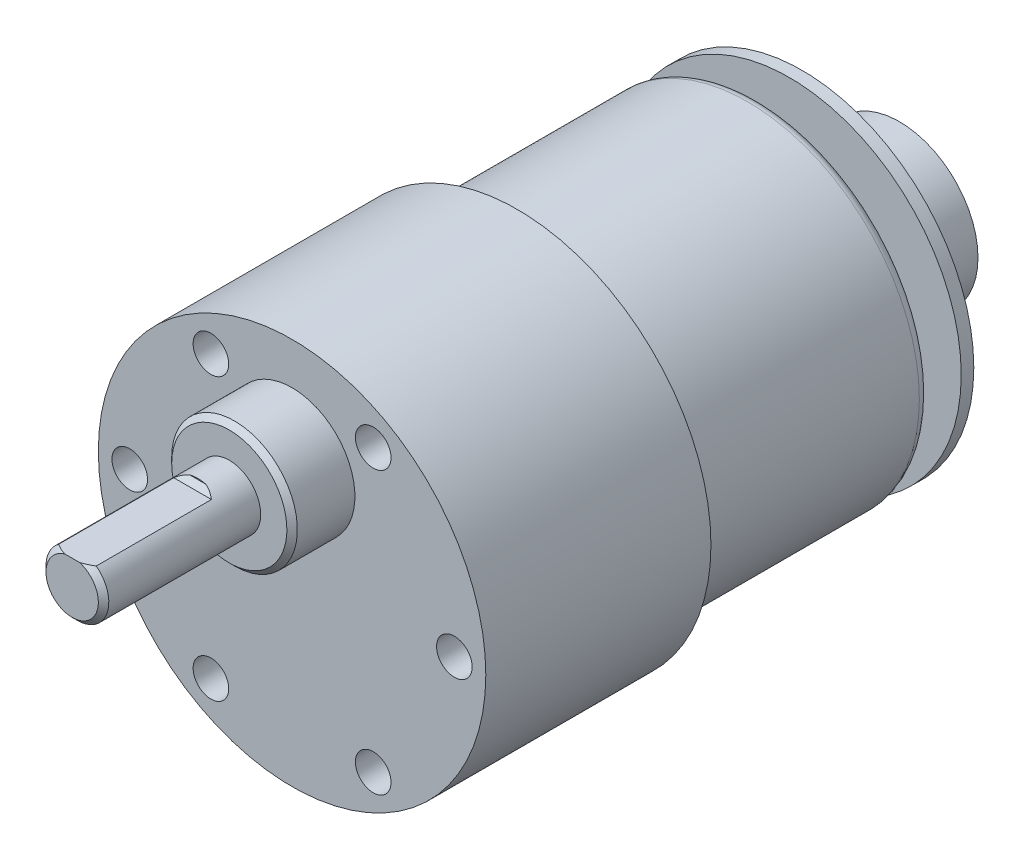
ISO-10303-21;
HEADER;
FILE_DESCRIPTION(('STEP AP214'),'2;1');
FILE_NAME('part.step','',(''),(''),'','','');
FILE_SCHEMA(('AUTOMOTIVE_DESIGN { 1 0 10303 214 1 1 1 1 }'));
ENDSEC;
DATA;
#1=APPLICATION_CONTEXT('core data for automotive mechanical design processes');
#2=APPLICATION_PROTOCOL_DEFINITION('international standard','automotive_design',2000,#1);
#3=PRODUCT_CONTEXT('',#1,'mechanical');
#4=PRODUCT('Part','Part','',(#3));
#5=PRODUCT_RELATED_PRODUCT_CATEGORY('part','',(#4));
#6=PRODUCT_DEFINITION_FORMATION('','',#4);
#7=PRODUCT_DEFINITION_CONTEXT('part definition',#1,'design');
#8=PRODUCT_DEFINITION('design','',#6,#7);
#9=PRODUCT_DEFINITION_SHAPE('','',#8);
#10=(LENGTH_UNIT() NAMED_UNIT(*) SI_UNIT(.MILLI.,.METRE.));
#11=(NAMED_UNIT(*) PLANE_ANGLE_UNIT() SI_UNIT($,.RADIAN.));
#12=(NAMED_UNIT(*) SI_UNIT($,.STERADIAN.) SOLID_ANGLE_UNIT());
#13=UNCERTAINTY_MEASURE_WITH_UNIT(LENGTH_MEASURE(1.E-05),#10,'distance_accuracy_value','');
#14=(GEOMETRIC_REPRESENTATION_CONTEXT(3) GLOBAL_UNCERTAINTY_ASSIGNED_CONTEXT((#13)) GLOBAL_UNIT_ASSIGNED_CONTEXT((#10,
#11,#12)) REPRESENTATION_CONTEXT('',''));
#15=CARTESIAN_POINT('',(0.,0.,0.));
#16=DIRECTION('',(0.,0.,1.));
#17=DIRECTION('',(1.,0.,0.));
#18=AXIS2_PLACEMENT_3D('',#15,#16,#17);
#19=CARTESIAN_POINT('',(0.,0.,0.));
#20=DIRECTION('',(0.,0.,1.));
#21=DIRECTION('',(1.,0.,0.));
#22=AXIS2_PLACEMENT_3D('',#19,#20,#21);
#23=PLANE('',#22);
#24=CARTESIAN_POINT('',(0.,0.,0.));
#25=DIRECTION('',(0.,0.,1.));
#26=DIRECTION('',(1.,0.,0.));
#27=AXIS2_PLACEMENT_3D('',#24,#25,#26);
#28=CIRCLE('',#27,15.4);
#29=CARTESIAN_POINT('',(15.4,0.,0.));
#30=VERTEX_POINT('',#29);
#31=EDGE_CURVE('E257',#30,#30,#28,.F.);
#32=ORIENTED_EDGE('',*,*,#31,.T.);
#33=EDGE_LOOP('',(#32));
#34=FACE_BOUND('',#33,.T.);
#35=CARTESIAN_POINT('',(0.,0.,0.));
#36=DIRECTION('',(0.,0.,1.));
#37=DIRECTION('',(1.,0.,0.));
#38=AXIS2_PLACEMENT_3D('',#35,#36,#37);
#39=CIRCLE('',#38,3.);
#40=CARTESIAN_POINT('',(3.,0.,0.));
#41=VERTEX_POINT('',#40);
#42=EDGE_CURVE('E164',#41,#41,#39,.T.);
#43=ORIENTED_EDGE('',*,*,#42,.T.);
#44=EDGE_LOOP('',(#43));
#45=FACE_BOUND('',#44,.T.);
#46=ADVANCED_FACE('F47',(#34,#45),#23,.F.);
#47=CARTESIAN_POINT('',(0.,0.,44.5));
#48=DIRECTION('',(0.,0.,1.));
#49=DIRECTION('',(1.,0.,0.));
#50=AXIS2_PLACEMENT_3D('',#47,#48,#49);
#51=CYLINDRICAL_SURFACE('',#50,16.4);
#52=CARTESIAN_POINT('',(0.,0.,1.));
#53=DIRECTION('',(0.,0.,1.));
#54=DIRECTION('',(1.,0.,0.));
#55=AXIS2_PLACEMENT_3D('',#52,#53,#54);
#56=CIRCLE('',#55,16.4);
#57=CARTESIAN_POINT('',(16.4,0.,1.));
#58=VERTEX_POINT('',#57);
#59=EDGE_CURVE('E384',#58,#58,#56,.T.);
#60=ORIENTED_EDGE('',*,*,#59,.T.);
#61=EDGE_LOOP('',(#60));
#62=FACE_BOUND('',#61,.T.);
#63=CARTESIAN_POINT('',(0.,0.,23.));
#64=DIRECTION('',(0.,0.,1.));
#65=DIRECTION('',(1.,0.,0.));
#66=AXIS2_PLACEMENT_3D('',#63,#64,#65);
#67=CIRCLE('',#66,16.4);
#68=CARTESIAN_POINT('',(16.4,0.,23.));
#69=VERTEX_POINT('',#68);
#70=EDGE_CURVE('E178',#69,#69,#67,.T.);
#71=ORIENTED_EDGE('',*,*,#70,.F.);
#72=EDGE_LOOP('',(#71));
#73=FACE_BOUND('',#72,.T.);
#74=ADVANCED_FACE('F246',(#62,#73),#51,.T.);
#75=CARTESIAN_POINT('',(0.,16.4,23.));
#76=DIRECTION('',(0.,0.,1.));
#77=DIRECTION('',(1.,0.,0.));
#78=AXIS2_PLACEMENT_3D('',#75,#76,#77);
#79=PLANE('',#78);
#80=CARTESIAN_POINT('',(0.,0.,23.));
#81=DIRECTION('',(0.,0.,1.));
#82=DIRECTION('',(1.,0.,0.));
#83=AXIS2_PLACEMENT_3D('',#80,#81,#82);
#84=CIRCLE('',#83,18.5);
#85=CARTESIAN_POINT('',(18.5,0.,23.));
#86=VERTEX_POINT('',#85);
#87=EDGE_CURVE('E175',#86,#86,#84,.T.);
#88=ORIENTED_EDGE('',*,*,#87,.F.);
#89=EDGE_LOOP('',(#88));
#90=FACE_BOUND('',#89,.T.);
#91=ORIENTED_EDGE('',*,*,#70,.T.);
#92=EDGE_LOOP('',(#91));
#93=FACE_BOUND('',#92,.T.);
#94=ADVANCED_FACE('F242',(#90,#93),#79,.F.);
#95=CARTESIAN_POINT('',(0.,0.,44.5));
#96=DIRECTION('',(0.,0.,1.));
#97=DIRECTION('',(1.,0.,0.));
#98=AXIS2_PLACEMENT_3D('',#95,#96,#97);
#99=CYLINDRICAL_SURFACE('',#98,18.5);
#100=CARTESIAN_POINT('',(0.,0.,44.5));
#101=DIRECTION('',(0.,0.,1.));
#102=DIRECTION('',(1.,0.,0.));
#103=AXIS2_PLACEMENT_3D('',#100,#101,#102);
#104=CIRCLE('',#103,18.5);
#105=CARTESIAN_POINT('',(18.5,0.,44.5));
#106=VERTEX_POINT('',#105);
#107=EDGE_CURVE('E172',#106,#106,#104,.T.);
#108=ORIENTED_EDGE('',*,*,#107,.F.);
#109=EDGE_LOOP('',(#108));
#110=FACE_BOUND('',#109,.T.);
#111=ORIENTED_EDGE('',*,*,#87,.T.);
#112=EDGE_LOOP('',(#111));
#113=FACE_BOUND('',#112,.T.);
#114=ADVANCED_FACE('F238',(#110,#113),#99,.T.);
#115=CARTESIAN_POINT('',(0.,18.5,44.5));
#116=DIRECTION('',(0.,0.,-1.));
#117=DIRECTION('',(-1.,0.,0.));
#118=AXIS2_PLACEMENT_3D('',#115,#116,#117);
#119=PLANE('',#118);
#120=CARTESIAN_POINT('',(7.75000000000016,13.4233937586587,44.5));
#121=DIRECTION('',(0.,0.,1.));
#122=DIRECTION('',(1.,0.,0.));
#123=AXIS2_PLACEMENT_3D('',#120,#121,#122);
#124=CIRCLE('',#123,1.69999999999999);
#125=CARTESIAN_POINT('',(9.45000000000014,13.4233937586587,44.5));
#126=VERTEX_POINT('',#125);
#127=EDGE_CURVE('E115',#126,#126,#124,.T.);
#128=ORIENTED_EDGE('',*,*,#127,.F.);
#129=EDGE_LOOP('',(#128));
#130=FACE_BOUND('',#129,.T.);
#131=CARTESIAN_POINT('',(-7.74999999999987,13.4233937586589,44.5));
#132=DIRECTION('',(0.,0.,1.));
#133=DIRECTION('',(1.,0.,0.));
#134=AXIS2_PLACEMENT_3D('',#131,#132,#133);
#135=CIRCLE('',#134,1.69999999999999);
#136=CARTESIAN_POINT('',(-6.04999999999989,13.4233937586589,44.5));
#137=VERTEX_POINT('',#136);
#138=EDGE_CURVE('E114',#137,#137,#135,.T.);
#139=ORIENTED_EDGE('',*,*,#138,.F.);
#140=EDGE_LOOP('',(#139));
#141=FACE_BOUND('',#140,.T.);
#142=CARTESIAN_POINT('',(-15.5,0.,44.5));
#143=DIRECTION('',(0.,0.,1.));
#144=DIRECTION('',(1.,0.,0.));
#145=AXIS2_PLACEMENT_3D('',#142,#143,#144);
#146=CIRCLE('',#145,1.69999999999999);
#147=CARTESIAN_POINT('',(-13.8,0.,44.5));
#148=VERTEX_POINT('',#147);
#149=EDGE_CURVE('E125',#148,#148,#146,.T.);
#150=ORIENTED_EDGE('',*,*,#149,.F.);
#151=EDGE_LOOP('',(#150));
#152=FACE_BOUND('',#151,.T.);
#153=CARTESIAN_POINT('',(-7.75000000000006,-13.4233937586588,44.5));
#154=DIRECTION('',(0.,0.,1.));
#155=DIRECTION('',(1.,0.,0.));
#156=AXIS2_PLACEMENT_3D('',#153,#154,#155);
#157=CIRCLE('',#156,1.69999999999999);
#158=CARTESIAN_POINT('',(-6.05000000000007,-13.4233937586588,44.5));
#159=VERTEX_POINT('',#158);
#160=EDGE_CURVE('E131',#159,#159,#157,.T.);
#161=ORIENTED_EDGE('',*,*,#160,.F.);
#162=EDGE_LOOP('',(#161));
#163=FACE_BOUND('',#162,.T.);
#164=CARTESIAN_POINT('',(7.74999999999997,-13.4233937586588,44.5));
#165=DIRECTION('',(0.,0.,1.));
#166=DIRECTION('',(1.,0.,0.));
#167=AXIS2_PLACEMENT_3D('',#164,#165,#166);
#168=CIRCLE('',#167,1.69999999999999);
#169=CARTESIAN_POINT('',(9.44999999999996,-13.4233937586588,44.5));
#170=VERTEX_POINT('',#169);
#171=EDGE_CURVE('E137',#170,#170,#168,.T.);
#172=ORIENTED_EDGE('',*,*,#171,.F.);
#173=EDGE_LOOP('',(#172));
#174=FACE_BOUND('',#173,.T.);
#175=CARTESIAN_POINT('',(15.5,0.,44.5));
#176=DIRECTION('',(0.,0.,1.));
#177=DIRECTION('',(1.,0.,0.));
#178=AXIS2_PLACEMENT_3D('',#175,#176,#177);
#179=CIRCLE('',#178,1.69999999999999);
#180=CARTESIAN_POINT('',(17.2,0.,44.5));
#181=VERTEX_POINT('',#180);
#182=EDGE_CURVE('E143',#181,#181,#179,.T.);
#183=ORIENTED_EDGE('',*,*,#182,.F.);
#184=EDGE_LOOP('',(#183));
#185=FACE_BOUND('',#184,.T.);
#186=CARTESIAN_POINT('',(0.,8.50000000000001,44.5));
#187=DIRECTION('',(0.,0.,-1.));
#188=DIRECTION('',(-1.,0.,0.));
#189=AXIS2_PLACEMENT_3D('',#186,#187,#188);
#190=CIRCLE('',#189,6.);
#191=CARTESIAN_POINT('',(-6.,8.50000000000001,44.5));
#192=VERTEX_POINT('',#191);
#193=EDGE_CURVE('E181',#192,#192,#190,.F.);
#194=ORIENTED_EDGE('',*,*,#193,.F.);
#195=EDGE_LOOP('',(#194));
#196=FACE_BOUND('',#195,.T.);
#197=ORIENTED_EDGE('',*,*,#107,.T.);
#198=EDGE_LOOP('',(#197));
#199=FACE_BOUND('',#198,.T.);
#200=ADVANCED_FACE('F234',(#130,#141,#152,#163,#174,#185,#196,#199),#119,.F.);
#201=CARTESIAN_POINT('',(0.,8.50000000000001,50.4953418063942));
#202=DIRECTION('',(0.,0.,1.));
#203=DIRECTION('',(0.,-1.,0.));
#204=AXIS2_PLACEMENT_3D('',#201,#202,#203);
#205=CYLINDRICAL_SURFACE('',#204,6.);
#206=CARTESIAN_POINT('',(0.,8.50000000000001,49.9953418063942));
#207=DIRECTION('',(0.,0.,-1.));
#208=DIRECTION('',(-1.,0.,0.));
#209=AXIS2_PLACEMENT_3D('',#206,#207,#208);
#210=CIRCLE('',#209,6.);
#211=CARTESIAN_POINT('',(-6.,8.50000000000001,49.9953418063942));
#212=VERTEX_POINT('',#211);
#213=EDGE_CURVE('E13',#212,#212,#210,.T.);
#214=ORIENTED_EDGE('',*,*,#213,.T.);
#215=EDGE_LOOP('',(#214));
#216=FACE_BOUND('',#215,.T.);
#217=ORIENTED_EDGE('',*,*,#193,.T.);
#218=EDGE_LOOP('',(#217));
#219=FACE_BOUND('',#218,.T.);
#220=ADVANCED_FACE('F230',(#216,#219),#205,.T.);
#221=CARTESIAN_POINT('',(0.,14.5,50.4953418063942));
#222=DIRECTION('',(0.,0.,-1.));
#223=DIRECTION('',(0.,1.,0.));
#224=AXIS2_PLACEMENT_3D('',#221,#222,#223);
#225=PLANE('',#224);
#226=CARTESIAN_POINT('',(0.,8.50000000000001,50.4953418063942));
#227=DIRECTION('',(0.,0.,-1.));
#228=DIRECTION('',(0.,1.,0.));
#229=AXIS2_PLACEMENT_3D('',#226,#227,#228);
#230=CIRCLE('',#229,5.50000000000001);
#231=CARTESIAN_POINT('',(0.,14.,50.4953418063942));
#232=VERTEX_POINT('',#231);
#233=EDGE_CURVE('E55',#232,#232,#230,.F.);
#234=ORIENTED_EDGE('',*,*,#233,.T.);
#235=EDGE_LOOP('',(#234));
#236=FACE_BOUND('',#235,.T.);
#237=CARTESIAN_POINT('',(0.,8.50000000000001,50.4953418063942));
#238=DIRECTION('',(0.,0.,-1.));
#239=DIRECTION('',(0.,1.,0.));
#240=AXIS2_PLACEMENT_3D('',#237,#238,#239);
#241=CIRCLE('',#240,3.);
#242=CARTESIAN_POINT('',(0.,11.5,50.4953418063942));
#243=VERTEX_POINT('',#242);
#244=EDGE_CURVE('E169',#243,#243,#241,.T.);
#245=ORIENTED_EDGE('',*,*,#244,.T.);
#246=EDGE_LOOP('',(#245));
#247=FACE_BOUND('',#246,.T.);
#248=ADVANCED_FACE('F227',(#236,#247),#225,.F.);
#249=CARTESIAN_POINT('',(0.,8.50000000000001,65.5));
#250=DIRECTION('',(0.,0.,1.));
#251=DIRECTION('',(0.,-1.,0.));
#252=AXIS2_PLACEMENT_3D('',#249,#250,#251);
#253=PLANE('',#252);
#254=DIRECTION('',(1.,0.,0.));
#255=VECTOR('',#254,1.);
#256=CARTESIAN_POINT('',(-2.5,10.9,65.5));
#257=LINE('',#256,#255);
#258=CARTESIAN_POINT('',(-0.700000000000028,10.9,65.5));
#259=VERTEX_POINT('',#258);
#260=CARTESIAN_POINT('',(0.700000000000023,10.9,65.5));
#261=VERTEX_POINT('',#260);
#262=EDGE_CURVE('E167',#259,#261,#257,.T.);
#263=ORIENTED_EDGE('',*,*,#262,.F.);
#264=CARTESIAN_POINT('',(0.,8.50000000000001,65.5));
#265=DIRECTION('',(0.,0.,1.));
#266=DIRECTION('',(0.,-1.,0.));
#267=AXIS2_PLACEMENT_3D('',#264,#265,#266);
#268=CIRCLE('',#267,2.50000000000001);
#269=EDGE_CURVE('E61',#259,#261,#268,.T.);
#270=ORIENTED_EDGE('',*,*,#269,.T.);
#271=EDGE_LOOP('',(#263,#270));
#272=FACE_BOUND('',#271,.T.);
#273=ADVANCED_FACE('F223',(#272),#253,.T.);
#274=CARTESIAN_POINT('',(0.,8.50000000000001,50.4953418063942));
#275=DIRECTION('',(0.,0.,-1.));
#276=DIRECTION('',(0.,1.,0.));
#277=AXIS2_PLACEMENT_3D('',#274,#275,#276);
#278=CYLINDRICAL_SURFACE('',#277,3.);
#279=DIRECTION('',(0.,0.,-1.));
#280=VECTOR('',#279,1.);
#281=CARTESIAN_POINT('',(1.79999999999999,10.9,50.4953418063942));
#282=LINE('',#281,#280);
#283=CARTESIAN_POINT('',(1.79999999999999,10.9,65.));
#284=VERTEX_POINT('',#283);
#285=CARTESIAN_POINT('',(1.79999999999999,10.9,54.));
#286=VERTEX_POINT('',#285);
#287=EDGE_CURVE('E187',#284,#286,#282,.T.);
#288=ORIENTED_EDGE('',*,*,#287,.F.);
#289=CARTESIAN_POINT('',(0.,8.50000000000001,65.));
#290=DIRECTION('',(0.,0.,1.));
#291=DIRECTION('',(1.,0.,0.));
#292=AXIS2_PLACEMENT_3D('',#289,#290,#291);
#293=CIRCLE('',#292,3.);
#294=CARTESIAN_POINT('',(-1.8,10.9,65.));
#295=VERTEX_POINT('',#294);
#296=EDGE_CURVE('E192',#284,#295,#293,.F.);
#297=ORIENTED_EDGE('',*,*,#296,.T.);
#298=DIRECTION('',(0.,0.,-1.));
#299=VECTOR('',#298,1.);
#300=CARTESIAN_POINT('',(-1.8,10.9,50.4953418063942));
#301=LINE('',#300,#299);
#302=CARTESIAN_POINT('',(-1.8,10.9,54.));
#303=VERTEX_POINT('',#302);
#304=EDGE_CURVE('E190',#303,#295,#301,.F.);
#305=ORIENTED_EDGE('',*,*,#304,.F.);
#306=CARTESIAN_POINT('',(0.,8.50000000000001,56.4));
#307=DIRECTION('',(0.,-0.707106781186546,-0.707106781186549));
#308=DIRECTION('',(0.,0.707106781186549,-0.707106781186546));
#309=AXIS2_PLACEMENT_3D('',#306,#307,#308);
#310=ELLIPSE('',#309,4.24264068711927,3.);
#311=CARTESIAN_POINT('',(-0.768114574786843,11.4,53.5));
#312=VERTEX_POINT('',#311);
#313=EDGE_CURVE('E379',#303,#312,#310,.T.);
#314=ORIENTED_EDGE('',*,*,#313,.T.);
#315=CARTESIAN_POINT('',(0.,8.50000000000001,53.5));
#316=DIRECTION('',(0.,0.,1.));
#317=DIRECTION('',(1.,0.,0.));
#318=AXIS2_PLACEMENT_3D('',#315,#316,#317);
#319=CIRCLE('',#318,3.);
#320=CARTESIAN_POINT('',(0.768114574786841,11.4,53.5));
#321=VERTEX_POINT('',#320);
#322=EDGE_CURVE('E184',#312,#321,#319,.F.);
#323=ORIENTED_EDGE('',*,*,#322,.T.);
#324=CARTESIAN_POINT('',(0.,8.50000000000001,56.4));
#325=DIRECTION('',(0.,-0.707106781186546,-0.707106781186549));
#326=DIRECTION('',(0.,0.707106781186549,-0.707106781186546));
#327=AXIS2_PLACEMENT_3D('',#324,#325,#326);
#328=ELLIPSE('',#327,4.24264068711927,3.);
#329=EDGE_CURVE('E385',#321,#286,#328,.T.);
#330=ORIENTED_EDGE('',*,*,#329,.T.);
#331=EDGE_LOOP('',(#288,#297,#305,#314,#323,#330));
#332=FACE_BOUND('',#331,.T.);
#333=ORIENTED_EDGE('',*,*,#244,.F.);
#334=EDGE_LOOP('',(#333));
#335=FACE_BOUND('',#334,.T.);
#336=ADVANCED_FACE('F218',(#332,#335),#278,.T.);
#337=CARTESIAN_POINT('',(-2.5,10.9,53.5));
#338=DIRECTION('',(0.,-1.,0.));
#339=DIRECTION('',(1.,0.,0.));
#340=AXIS2_PLACEMENT_3D('',#337,#338,#339);
#341=PLANE('',#340);
#342=ORIENTED_EDGE('',*,*,#304,.T.);
#343=CARTESIAN_POINT('',(-1.8,10.9,65.));
#344=CARTESIAN_POINT('',(-1.71328017008279,10.9,65.0519748456244));
#345=CARTESIAN_POINT('',(-1.62549702198272,10.9,65.102292589561));
#346=CARTESIAN_POINT('',(-1.44784480086308,10.9,65.1981082480505));
#347=CARTESIAN_POINT('',(-1.35798648315313,10.9,65.243626208176));
#348=CARTESIAN_POINT('',(-1.17535654550083,10.9,65.3288672801642));
#349=CARTESIAN_POINT('',(-1.08258129797687,10.9,65.3685827991208));
#350=CARTESIAN_POINT('',(-0.893716733445468,10.9,65.4404872202744));
#351=CARTESIAN_POINT('',(-0.797614651158119,10.9,65.4726423010784));
#352=CARTESIAN_POINT('',(-0.700000000000023,10.9,65.5));
#353=B_SPLINE_CURVE_WITH_KNOTS('',3,(#343,#344,#345,#346,#347,#348,#349,#350,#351,#352),
.UNSPECIFIED.,.F.,.F.,(4,2,2,2,4),(0.,0.303374329953433,0.605426803912711,0.907871061241083,
1.21164359203915),.UNSPECIFIED.);
#354=EDGE_CURVE('E68',#295,#259,#353,.T.);
#355=ORIENTED_EDGE('',*,*,#354,.T.);
#356=ORIENTED_EDGE('',*,*,#262,.T.);
#357=CARTESIAN_POINT('',(0.700000000000024,10.9,65.5));
#358=CARTESIAN_POINT('',(0.79761465115812,10.9,65.4726423010784));
#359=CARTESIAN_POINT('',(0.893716733445468,10.9,65.4404872202744));
#360=CARTESIAN_POINT('',(1.08258129797687,10.9,65.3685827991208));
#361=CARTESIAN_POINT('',(1.17535654550083,10.9,65.3288672801642));
#362=CARTESIAN_POINT('',(1.35798648315313,10.9,65.243626208176));
#363=CARTESIAN_POINT('',(1.44784480086308,10.9,65.1981082480505));
#364=CARTESIAN_POINT('',(1.62549702198271,10.9,65.102292589561));
#365=CARTESIAN_POINT('',(1.71328017008279,10.9,65.0519748456244));
#366=CARTESIAN_POINT('',(1.79999999999999,10.9,65.));
#367=B_SPLINE_CURVE_WITH_KNOTS('',3,(#357,#358,#359,#360,#361,#362,#363,#364,#365,#366),
.UNSPECIFIED.,.F.,.F.,(4,2,2,2,4),(0.,0.303772530798068,0.606216788126439,0.908269262085716,
1.21164359203915),.UNSPECIFIED.);
#368=EDGE_CURVE('E197',#261,#284,#367,.T.);
#369=ORIENTED_EDGE('',*,*,#368,.T.);
#370=ORIENTED_EDGE('',*,*,#287,.T.);
#371=DIRECTION('',(-1.,0.,0.));
#372=VECTOR('',#371,1.);
#373=CARTESIAN_POINT('',(-2.5,10.9,54.));
#374=LINE('',#373,#372);
#375=EDGE_CURVE('E195',#286,#303,#374,.T.);
#376=ORIENTED_EDGE('',*,*,#375,.T.);
#377=EDGE_LOOP('',(#342,#355,#356,#369,#370,#376));
#378=FACE_BOUND('',#377,.T.);
#379=ADVANCED_FACE('F212',(#378),#341,.F.);
#380=CARTESIAN_POINT('',(0.,0.,53.5));
#381=DIRECTION('',(0.,0.,1.));
#382=DIRECTION('',(1.,0.,0.));
#383=AXIS2_PLACEMENT_3D('',#380,#381,#382);
#384=PLANE('',#383);
#385=ORIENTED_EDGE('',*,*,#322,.F.);
#386=DIRECTION('',(1.,0.,0.));
#387=VECTOR('',#386,1.);
#388=CARTESIAN_POINT('',(0.,11.4,53.5));
#389=LINE('',#388,#387);
#390=EDGE_CURVE('E381',#312,#321,#389,.T.);
#391=ORIENTED_EDGE('',*,*,#390,.T.);
#392=EDGE_LOOP('',(#385,#391));
#393=FACE_BOUND('',#392,.T.);
#394=ADVANCED_FACE('F217',(#393),#384,.T.);
#395=CARTESIAN_POINT('',(0.,8.50000000000001,65.));
#396=DIRECTION('',(0.,0.,-1.));
#397=DIRECTION('',(-1.,0.,0.));
#398=AXIS2_PLACEMENT_3D('',#395,#396,#397);
#399=CONICAL_SURFACE('',#398,3.,0.78539816339745);
#400=ORIENTED_EDGE('',*,*,#368,.F.);
#401=ORIENTED_EDGE('',*,*,#269,.F.);
#402=ORIENTED_EDGE('',*,*,#354,.F.);
#403=ORIENTED_EDGE('',*,*,#296,.F.);
#404=EDGE_LOOP('',(#400,#401,#402,#403));
#405=FACE_BOUND('',#404,.T.);
#406=ADVANCED_FACE('F208',(#405),#399,.T.);
#407=CARTESIAN_POINT('',(0.,11.4,53.5));
#408=DIRECTION('',(0.,-0.707106781186546,-0.707106781186549));
#409=DIRECTION('',(1.,0.,0.));
#410=AXIS2_PLACEMENT_3D('',#407,#408,#409);
#411=PLANE('',#410);
#412=ORIENTED_EDGE('',*,*,#313,.F.);
#413=ORIENTED_EDGE('',*,*,#375,.F.);
#414=ORIENTED_EDGE('',*,*,#329,.F.);
#415=ORIENTED_EDGE('',*,*,#390,.F.);
#416=EDGE_LOOP('',(#412,#413,#414,#415));
#417=FACE_BOUND('',#416,.T.);
#418=ADVANCED_FACE('F264',(#417),#411,.F.);
#419=CARTESIAN_POINT('',(0.,0.,0.));
#420=DIRECTION('',(0.,0.,1.));
#421=DIRECTION('',(1.,0.,0.));
#422=AXIS2_PLACEMENT_3D('',#419,#420,#421);
#423=CYLINDRICAL_SURFACE('',#422,3.);
#424=ORIENTED_EDGE('',*,*,#42,.F.);
#425=EDGE_LOOP('',(#424));
#426=FACE_BOUND('',#425,.T.);
#427=CARTESIAN_POINT('',(0.,0.,-3.));
#428=DIRECTION('',(0.,0.,1.));
#429=DIRECTION('',(1.,0.,0.));
#430=AXIS2_PLACEMENT_3D('',#427,#428,#429);
#431=CIRCLE('',#430,3.);
#432=CARTESIAN_POINT('',(3.,0.,-3.));
#433=VERTEX_POINT('',#432);
#434=EDGE_CURVE('E161',#433,#433,#431,.T.);
#435=ORIENTED_EDGE('',*,*,#434,.T.);
#436=EDGE_LOOP('',(#435));
#437=FACE_BOUND('',#436,.T.);
#438=ADVANCED_FACE('F260',(#426,#437),#423,.T.);
#439=CARTESIAN_POINT('',(0.,0.,-3.));
#440=DIRECTION('',(0.,0.,-1.));
#441=DIRECTION('',(-1.,0.,0.));
#442=AXIS2_PLACEMENT_3D('',#439,#440,#441);
#443=PLANE('',#442);
#444=ORIENTED_EDGE('',*,*,#434,.F.);
#445=EDGE_LOOP('',(#444));
#446=FACE_BOUND('',#445,.T.);
#447=CARTESIAN_POINT('',(0.,0.,-3.));
#448=DIRECTION('',(0.,0.,1.));
#449=DIRECTION('',(1.,0.,0.));
#450=AXIS2_PLACEMENT_3D('',#447,#448,#449);
#451=CIRCLE('',#450,16.4);
#452=CARTESIAN_POINT('',(16.4,0.,-3.));
#453=VERTEX_POINT('',#452);
#454=EDGE_CURVE('E158',#453,#453,#451,.T.);
#455=ORIENTED_EDGE('',*,*,#454,.T.);
#456=EDGE_LOOP('',(#455));
#457=FACE_BOUND('',#456,.T.);
#458=ADVANCED_FACE('F263',(#446,#457),#443,.F.);
#459=CARTESIAN_POINT('',(0.,0.,-3.));
#460=DIRECTION('',(0.,0.,1.));
#461=DIRECTION('',(1.,0.,0.));
#462=AXIS2_PLACEMENT_3D('',#459,#460,#461);
#463=CYLINDRICAL_SURFACE('',#462,16.4);
#464=ORIENTED_EDGE('',*,*,#454,.F.);
#465=EDGE_LOOP('',(#464));
#466=FACE_BOUND('',#465,.T.);
#467=CARTESIAN_POINT('',(0.,0.,-4.2));
#468=DIRECTION('',(0.,0.,1.));
#469=DIRECTION('',(1.,0.,0.));
#470=AXIS2_PLACEMENT_3D('',#467,#468,#469);
#471=CIRCLE('',#470,16.4);
#472=CARTESIAN_POINT('',(16.4,0.,-4.2));
#473=VERTEX_POINT('',#472);
#474=EDGE_CURVE('E155',#473,#473,#471,.T.);
#475=ORIENTED_EDGE('',*,*,#474,.T.);
#476=EDGE_LOOP('',(#475));
#477=FACE_BOUND('',#476,.T.);
#478=ADVANCED_FACE('F269',(#466,#477),#463,.T.);
#479=CARTESIAN_POINT('',(0.,0.,-4.2));
#480=DIRECTION('',(0.,0.,1.));
#481=DIRECTION('',(1.,0.,0.));
#482=AXIS2_PLACEMENT_3D('',#479,#480,#481);
#483=PLANE('',#482);
#484=CARTESIAN_POINT('',(0.,0.,-4.2));
#485=DIRECTION('',(0.,0.,1.));
#486=DIRECTION('',(1.,0.,0.));
#487=AXIS2_PLACEMENT_3D('',#484,#485,#486);
#488=CIRCLE('',#487,7.5);
#489=CARTESIAN_POINT('',(7.5,0.,-4.2));
#490=VERTEX_POINT('',#489);
#491=EDGE_CURVE('E152',#490,#490,#488,.T.);
#492=ORIENTED_EDGE('',*,*,#491,.T.);
#493=EDGE_LOOP('',(#492));
#494=FACE_BOUND('',#493,.T.);
#495=ORIENTED_EDGE('',*,*,#474,.F.);
#496=EDGE_LOOP('',(#495));
#497=FACE_BOUND('',#496,.T.);
#498=ADVANCED_FACE('F275',(#494,#497),#483,.F.);
#499=CARTESIAN_POINT('',(0.,0.,-4.2));
#500=DIRECTION('',(0.,0.,1.));
#501=DIRECTION('',(1.,0.,0.));
#502=AXIS2_PLACEMENT_3D('',#499,#500,#501);
#503=CYLINDRICAL_SURFACE('',#502,7.5);
#504=ORIENTED_EDGE('',*,*,#491,.F.);
#505=EDGE_LOOP('',(#504));
#506=FACE_BOUND('',#505,.T.);
#507=CARTESIAN_POINT('',(0.,0.,-13.5));
#508=DIRECTION('',(0.,0.,1.));
#509=DIRECTION('',(1.,0.,0.));
#510=AXIS2_PLACEMENT_3D('',#507,#508,#509);
#511=CIRCLE('',#510,7.5);
#512=CARTESIAN_POINT('',(7.5,0.,-13.5));
#513=VERTEX_POINT('',#512);
#514=EDGE_CURVE('E149',#513,#513,#511,.T.);
#515=ORIENTED_EDGE('',*,*,#514,.T.);
#516=EDGE_LOOP('',(#515));
#517=FACE_BOUND('',#516,.T.);
#518=ADVANCED_FACE('F280',(#506,#517),#503,.T.);
#519=CARTESIAN_POINT('',(0.,0.,-13.5));
#520=DIRECTION('',(0.,0.,1.));
#521=DIRECTION('',(1.,0.,0.));
#522=AXIS2_PLACEMENT_3D('',#519,#520,#521);
#523=PLANE('',#522);
#524=ORIENTED_EDGE('',*,*,#514,.F.);
#525=EDGE_LOOP('',(#524));
#526=FACE_BOUND('',#525,.T.);
#527=ADVANCED_FACE('F286',(#526),#523,.F.);
#528=CARTESIAN_POINT('',(15.5,0.,34.5));
#529=DIRECTION('',(0.,0.,1.));
#530=DIRECTION('',(1.,0.,0.));
#531=AXIS2_PLACEMENT_3D('',#528,#529,#530);
#532=CONICAL_SURFACE('',#531,1.7,1.02974425867665);
#533=CARTESIAN_POINT('',(15.5,0.,33.4785369476531));
#534=VERTEX_POINT('',#533);
#535=VERTEX_LOOP('',#534);
#536=FACE_BOUND('',#535,.T.);
#537=CARTESIAN_POINT('',(15.5,0.,34.5));
#538=DIRECTION('',(0.,0.,1.));
#539=DIRECTION('',(1.,0.,0.));
#540=AXIS2_PLACEMENT_3D('',#537,#538,#539);
#541=CIRCLE('',#540,1.7);
#542=CARTESIAN_POINT('',(17.2,0.,34.5));
#543=VERTEX_POINT('',#542);
#544=EDGE_CURVE('E146',#543,#543,#541,.T.);
#545=ORIENTED_EDGE('',*,*,#544,.T.);
#546=EDGE_LOOP('',(#545));
#547=FACE_BOUND('',#546,.T.);
#548=ADVANCED_FACE('F292',(#536,#547),#532,.F.);
#549=CARTESIAN_POINT('',(15.5,0.,44.5));
#550=DIRECTION('',(0.,0.,1.));
#551=DIRECTION('',(1.,0.,0.));
#552=AXIS2_PLACEMENT_3D('',#549,#550,#551);
#553=CYLINDRICAL_SURFACE('',#552,1.69999999999999);
#554=ORIENTED_EDGE('',*,*,#544,.F.);
#555=EDGE_LOOP('',(#554));
#556=FACE_BOUND('',#555,.T.);
#557=ORIENTED_EDGE('',*,*,#182,.T.);
#558=EDGE_LOOP('',(#557));
#559=FACE_BOUND('',#558,.T.);
#560=ADVANCED_FACE('F296',(#556,#559),#553,.F.);
#561=CARTESIAN_POINT('',(7.74999999999997,-13.4233937586588,34.5));
#562=DIRECTION('',(0.,0.,1.));
#563=DIRECTION('',(1.,0.,0.));
#564=AXIS2_PLACEMENT_3D('',#561,#562,#563);
#565=CONICAL_SURFACE('',#564,1.7,1.02974425867665);
#566=CARTESIAN_POINT('',(7.74999999999997,-13.4233937586588,33.4785369476531));
#567=VERTEX_POINT('',#566);
#568=VERTEX_LOOP('',#567);
#569=FACE_BOUND('',#568,.T.);
#570=CARTESIAN_POINT('',(7.74999999999997,-13.4233937586588,34.5));
#571=DIRECTION('',(0.,0.,1.));
#572=DIRECTION('',(1.,0.,0.));
#573=AXIS2_PLACEMENT_3D('',#570,#571,#572);
#574=CIRCLE('',#573,1.7);
#575=CARTESIAN_POINT('',(9.44999999999997,-13.4233937586588,34.5));
#576=VERTEX_POINT('',#575);
#577=EDGE_CURVE('E140',#576,#576,#574,.T.);
#578=ORIENTED_EDGE('',*,*,#577,.T.);
#579=EDGE_LOOP('',(#578));
#580=FACE_BOUND('',#579,.T.);
#581=ADVANCED_FACE('F300',(#569,#580),#565,.F.);
#582=CARTESIAN_POINT('',(7.74999999999997,-13.4233937586588,44.5));
#583=DIRECTION('',(0.,0.,1.));
#584=DIRECTION('',(1.,0.,0.));
#585=AXIS2_PLACEMENT_3D('',#582,#583,#584);
#586=CYLINDRICAL_SURFACE('',#585,1.69999999999999);
#587=ORIENTED_EDGE('',*,*,#577,.F.);
#588=EDGE_LOOP('',(#587));
#589=FACE_BOUND('',#588,.T.);
#590=ORIENTED_EDGE('',*,*,#171,.T.);
#591=EDGE_LOOP('',(#590));
#592=FACE_BOUND('',#591,.T.);
#593=ADVANCED_FACE('F304',(#589,#592),#586,.F.);
#594=CARTESIAN_POINT('',(-7.75000000000006,-13.4233937586588,34.5));
#595=DIRECTION('',(0.,0.,1.));
#596=DIRECTION('',(1.,0.,0.));
#597=AXIS2_PLACEMENT_3D('',#594,#595,#596);
#598=CONICAL_SURFACE('',#597,1.7,1.02974425867665);
#599=CARTESIAN_POINT('',(-7.75000000000007,-13.4233937586588,33.4785369476531));
#600=VERTEX_POINT('',#599);
#601=VERTEX_LOOP('',#600);
#602=FACE_BOUND('',#601,.T.);
#603=CARTESIAN_POINT('',(-7.75000000000006,-13.4233937586588,34.5));
#604=DIRECTION('',(0.,0.,1.));
#605=DIRECTION('',(1.,0.,0.));
#606=AXIS2_PLACEMENT_3D('',#603,#604,#605);
#607=CIRCLE('',#606,1.7);
#608=CARTESIAN_POINT('',(-6.05000000000007,-13.4233937586588,34.5));
#609=VERTEX_POINT('',#608);
#610=EDGE_CURVE('E134',#609,#609,#607,.T.);
#611=ORIENTED_EDGE('',*,*,#610,.T.);
#612=EDGE_LOOP('',(#611));
#613=FACE_BOUND('',#612,.T.);
#614=ADVANCED_FACE('F308',(#602,#613),#598,.F.);
#615=CARTESIAN_POINT('',(-7.75000000000006,-13.4233937586588,44.5));
#616=DIRECTION('',(0.,0.,1.));
#617=DIRECTION('',(1.,0.,0.));
#618=AXIS2_PLACEMENT_3D('',#615,#616,#617);
#619=CYLINDRICAL_SURFACE('',#618,1.69999999999999);
#620=ORIENTED_EDGE('',*,*,#610,.F.);
#621=EDGE_LOOP('',(#620));
#622=FACE_BOUND('',#621,.T.);
#623=ORIENTED_EDGE('',*,*,#160,.T.);
#624=EDGE_LOOP('',(#623));
#625=FACE_BOUND('',#624,.T.);
#626=ADVANCED_FACE('F312',(#622,#625),#619,.F.);
#627=CARTESIAN_POINT('',(-15.5,0.,34.5));
#628=DIRECTION('',(0.,0.,1.));
#629=DIRECTION('',(1.,0.,0.));
#630=AXIS2_PLACEMENT_3D('',#627,#628,#629);
#631=CONICAL_SURFACE('',#630,1.7,1.02974425867665);
#632=CARTESIAN_POINT('',(-15.5,0.,33.4785369476531));
#633=VERTEX_POINT('',#632);
#634=VERTEX_LOOP('',#633);
#635=FACE_BOUND('',#634,.T.);
#636=CARTESIAN_POINT('',(-15.5,0.,34.5));
#637=DIRECTION('',(0.,0.,1.));
#638=DIRECTION('',(1.,0.,0.));
#639=AXIS2_PLACEMENT_3D('',#636,#637,#638);
#640=CIRCLE('',#639,1.7);
#641=CARTESIAN_POINT('',(-13.8,0.,34.5));
#642=VERTEX_POINT('',#641);
#643=EDGE_CURVE('E128',#642,#642,#640,.T.);
#644=ORIENTED_EDGE('',*,*,#643,.T.);
#645=EDGE_LOOP('',(#644));
#646=FACE_BOUND('',#645,.T.);
#647=ADVANCED_FACE('F316',(#635,#646),#631,.F.);
#648=CARTESIAN_POINT('',(-15.5,0.,44.5));
#649=DIRECTION('',(0.,0.,1.));
#650=DIRECTION('',(1.,0.,0.));
#651=AXIS2_PLACEMENT_3D('',#648,#649,#650);
#652=CYLINDRICAL_SURFACE('',#651,1.69999999999999);
#653=ORIENTED_EDGE('',*,*,#643,.F.);
#654=EDGE_LOOP('',(#653));
#655=FACE_BOUND('',#654,.T.);
#656=ORIENTED_EDGE('',*,*,#149,.T.);
#657=EDGE_LOOP('',(#656));
#658=FACE_BOUND('',#657,.T.);
#659=ADVANCED_FACE('F320',(#655,#658),#652,.F.);
#660=CARTESIAN_POINT('',(-7.74999999999987,13.4233937586589,34.5));
#661=DIRECTION('',(0.,0.,1.));
#662=DIRECTION('',(1.,0.,0.));
#663=AXIS2_PLACEMENT_3D('',#660,#661,#662);
#664=CONICAL_SURFACE('',#663,1.7,1.02974425867665);
#665=CARTESIAN_POINT('',(-7.74999999999988,13.4233937586589,33.4785369476531));
#666=VERTEX_POINT('',#665);
#667=VERTEX_LOOP('',#666);
#668=FACE_BOUND('',#667,.T.);
#669=CARTESIAN_POINT('',(-7.74999999999987,13.4233937586589,34.5));
#670=DIRECTION('',(0.,0.,1.));
#671=DIRECTION('',(1.,0.,0.));
#672=AXIS2_PLACEMENT_3D('',#669,#670,#671);
#673=CIRCLE('',#672,1.7);
#674=CARTESIAN_POINT('',(-6.04999999999988,13.4233937586589,34.5));
#675=VERTEX_POINT('',#674);
#676=EDGE_CURVE('E118',#675,#675,#673,.T.);
#677=ORIENTED_EDGE('',*,*,#676,.T.);
#678=EDGE_LOOP('',(#677));
#679=FACE_BOUND('',#678,.T.);
#680=ADVANCED_FACE('F324',(#668,#679),#664,.F.);
#681=CARTESIAN_POINT('',(-7.74999999999987,13.4233937586589,44.5));
#682=DIRECTION('',(0.,0.,1.));
#683=DIRECTION('',(1.,0.,0.));
#684=AXIS2_PLACEMENT_3D('',#681,#682,#683);
#685=CYLINDRICAL_SURFACE('',#684,1.69999999999999);
#686=ORIENTED_EDGE('',*,*,#676,.F.);
#687=EDGE_LOOP('',(#686));
#688=FACE_BOUND('',#687,.T.);
#689=ORIENTED_EDGE('',*,*,#138,.T.);
#690=EDGE_LOOP('',(#689));
#691=FACE_BOUND('',#690,.T.);
#692=ADVANCED_FACE('F108',(#688,#691),#685,.F.);
#693=CARTESIAN_POINT('',(7.75000000000016,13.4233937586587,34.5));
#694=DIRECTION('',(0.,0.,1.));
#695=DIRECTION('',(1.,0.,0.));
#696=AXIS2_PLACEMENT_3D('',#693,#694,#695);
#697=CONICAL_SURFACE('',#696,1.7,1.02974425867665);
#698=CARTESIAN_POINT('',(7.75000000000015,13.4233937586587,33.4785369476531));
#699=VERTEX_POINT('',#698);
#700=VERTEX_LOOP('',#699);
#701=FACE_BOUND('',#700,.T.);
#702=CARTESIAN_POINT('',(7.75000000000016,13.4233937586587,34.5));
#703=DIRECTION('',(0.,0.,1.));
#704=DIRECTION('',(1.,0.,0.));
#705=AXIS2_PLACEMENT_3D('',#702,#703,#704);
#706=CIRCLE('',#705,1.7);
#707=CARTESIAN_POINT('',(9.45000000000015,13.4233937586587,34.5));
#708=VERTEX_POINT('',#707);
#709=EDGE_CURVE('E112',#708,#708,#706,.T.);
#710=ORIENTED_EDGE('',*,*,#709,.T.);
#711=EDGE_LOOP('',(#710));
#712=FACE_BOUND('',#711,.T.);
#713=ADVANCED_FACE('F104',(#701,#712),#697,.F.);
#714=CARTESIAN_POINT('',(7.75000000000016,13.4233937586587,44.5));
#715=DIRECTION('',(0.,0.,1.));
#716=DIRECTION('',(1.,0.,0.));
#717=AXIS2_PLACEMENT_3D('',#714,#715,#716);
#718=CYLINDRICAL_SURFACE('',#717,1.69999999999999);
#719=ORIENTED_EDGE('',*,*,#709,.F.);
#720=EDGE_LOOP('',(#719));
#721=FACE_BOUND('',#720,.T.);
#722=ORIENTED_EDGE('',*,*,#127,.T.);
#723=EDGE_LOOP('',(#722));
#724=FACE_BOUND('',#723,.T.);
#725=ADVANCED_FACE('F107',(#721,#724),#718,.F.);
#726=CARTESIAN_POINT('',(0.,0.,1.));
#727=DIRECTION('',(0.,0.,1.));
#728=DIRECTION('',(1.,0.,0.));
#729=AXIS2_PLACEMENT_3D('',#726,#727,#728);
#730=TOROIDAL_SURFACE('',#729,15.4,1.);
#731=ORIENTED_EDGE('',*,*,#31,.F.);
#732=EDGE_LOOP('',(#731));
#733=FACE_BOUND('',#732,.T.);
#734=ORIENTED_EDGE('',*,*,#59,.F.);
#735=EDGE_LOOP('',(#734));
#736=FACE_BOUND('',#735,.T.);
#737=ADVANCED_FACE('F333',(#733,#736),#730,.T.);
#738=CARTESIAN_POINT('',(0.,8.50000000000001,50.4953418063942));
#739=DIRECTION('',(0.,0.,-1.));
#740=DIRECTION('',(-1.,0.,0.));
#741=AXIS2_PLACEMENT_3D('',#738,#739,#740);
#742=CONICAL_SURFACE('',#741,5.5,0.785398163397444);
#743=ORIENTED_EDGE('',*,*,#213,.F.);
#744=EDGE_LOOP('',(#743));
#745=FACE_BOUND('',#744,.T.);
#746=ORIENTED_EDGE('',*,*,#233,.F.);
#747=EDGE_LOOP('',(#746));
#748=FACE_BOUND('',#747,.T.);
#749=ADVANCED_FACE('F49',(#745,#748),#742,.T.);
#750=CLOSED_SHELL('',(#46,#74,#94,#114,#200,#220,#248,#273,#336,#379,#394,#406,#418,#438,#458,
#478,#498,#518,#527,#548,#560,#581,#593,#614,#626,#647,#659,#680,#692,#713,#725,#737,#749));
#751=MANIFOLD_SOLID_BREP('B2',#750);
#752=ADVANCED_BREP_SHAPE_REPRESENTATION('',(#18,#751),#14);
#753=SHAPE_DEFINITION_REPRESENTATION(#9,#752);
ENDSEC;
END-ISO-10303-21;
